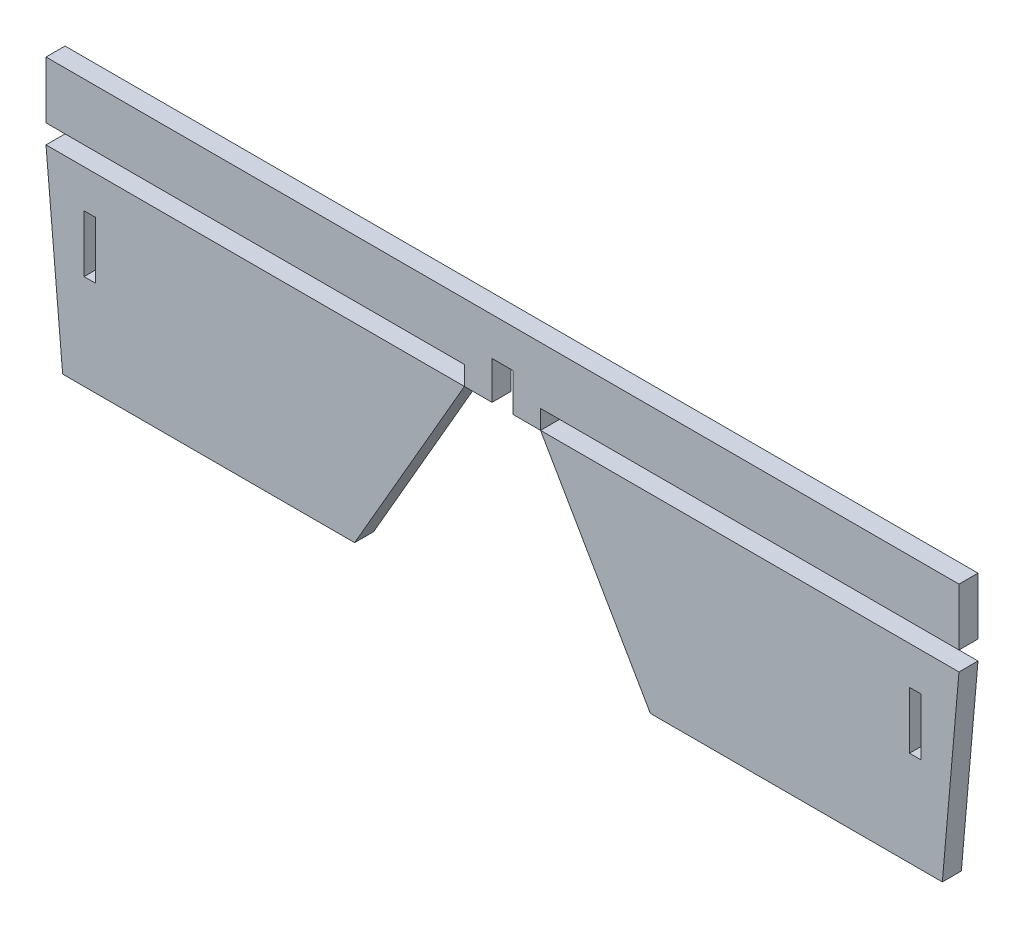
ISO-10303-21;
HEADER;
FILE_DESCRIPTION(('STEP AP214'),'2;1');
FILE_NAME('part.step','',(''),(''),'','','');
FILE_SCHEMA(('AUTOMOTIVE_DESIGN { 1 0 10303 214 1 1 1 1 }'));
ENDSEC;
DATA;
#1=APPLICATION_CONTEXT('core data for automotive mechanical design processes');
#2=APPLICATION_PROTOCOL_DEFINITION('international standard','automotive_design',2000,#1);
#3=PRODUCT_CONTEXT('',#1,'mechanical');
#4=PRODUCT('Part','Part','',(#3));
#5=PRODUCT_RELATED_PRODUCT_CATEGORY('part','',(#4));
#6=PRODUCT_DEFINITION_FORMATION('','',#4);
#7=PRODUCT_DEFINITION_CONTEXT('part definition',#1,'design');
#8=PRODUCT_DEFINITION('design','',#6,#7);
#9=PRODUCT_DEFINITION_SHAPE('','',#8);
#10=(LENGTH_UNIT() NAMED_UNIT(*) SI_UNIT(.MILLI.,.METRE.));
#11=(NAMED_UNIT(*) PLANE_ANGLE_UNIT() SI_UNIT($,.RADIAN.));
#12=(NAMED_UNIT(*) SI_UNIT($,.STERADIAN.) SOLID_ANGLE_UNIT());
#13=UNCERTAINTY_MEASURE_WITH_UNIT(LENGTH_MEASURE(1.E-05),#10,'distance_accuracy_value','');
#14=(GEOMETRIC_REPRESENTATION_CONTEXT(3) GLOBAL_UNCERTAINTY_ASSIGNED_CONTEXT((#13)) GLOBAL_UNIT_ASSIGNED_CONTEXT((#10,
#11,#12)) REPRESENTATION_CONTEXT('',''));
#15=CARTESIAN_POINT('',(0.,0.,0.));
#16=DIRECTION('',(0.,0.,1.));
#17=DIRECTION('',(1.,0.,0.));
#18=AXIS2_PLACEMENT_3D('',#15,#16,#17);
#19=CARTESIAN_POINT('',(0.,-20.,2.5));
#20=DIRECTION('',(0.,1.,0.));
#21=DIRECTION('',(0.,0.,1.));
#22=AXIS2_PLACEMENT_3D('',#19,#20,#21);
#23=PLANE('',#22);
#24=DIRECTION('',(-1.,0.,0.));
#25=VECTOR('',#24,1.);
#26=CARTESIAN_POINT('',(0.,-20.,-2.5));
#27=LINE('',#26,#25);
#28=CARTESIAN_POINT('',(110.,-20.,-2.5));
#29=VERTEX_POINT('',#28);
#30=CARTESIAN_POINT('',(107.,-20.,-2.5));
#31=VERTEX_POINT('',#30);
#32=EDGE_CURVE('E154',#29,#31,#27,.T.);
#33=ORIENTED_EDGE('',*,*,#32,.F.);
#34=DIRECTION('',(0.,0.,-1.));
#35=VECTOR('',#34,1.);
#36=CARTESIAN_POINT('',(110.,-20.,2.5));
#37=LINE('',#36,#35);
#38=CARTESIAN_POINT('',(110.,-20.,2.5));
#39=VERTEX_POINT('',#38);
#40=EDGE_CURVE('E161',#39,#29,#37,.T.);
#41=ORIENTED_EDGE('',*,*,#40,.F.);
#42=DIRECTION('',(-1.,0.,0.));
#43=VECTOR('',#42,1.);
#44=CARTESIAN_POINT('',(0.,-20.,2.5));
#45=LINE('',#44,#43);
#46=CARTESIAN_POINT('',(107.,-20.,2.5));
#47=VERTEX_POINT('',#46);
#48=EDGE_CURVE('E136',#39,#47,#45,.T.);
#49=ORIENTED_EDGE('',*,*,#48,.T.);
#50=DIRECTION('',(0.,0.,-1.));
#51=VECTOR('',#50,1.);
#52=CARTESIAN_POINT('',(107.,-20.,2.5));
#53=LINE('',#52,#51);
#54=EDGE_CURVE('E12',#47,#31,#53,.T.);
#55=ORIENTED_EDGE('',*,*,#54,.T.);
#56=EDGE_LOOP('',(#33,#41,#49,#55));
#57=FACE_BOUND('',#56,.T.);
#58=ADVANCED_FACE('F46',(#57),#23,.F.);
#59=CARTESIAN_POINT('',(107.,0.,2.5));
#60=DIRECTION('',(-1.,0.,0.));
#61=DIRECTION('',(0.,1.,0.));
#62=AXIS2_PLACEMENT_3D('',#59,#60,#61);
#63=PLANE('',#62);
#64=DIRECTION('',(0.,-1.,0.));
#65=VECTOR('',#64,1.);
#66=CARTESIAN_POINT('',(107.,0.,-2.5));
#67=LINE('',#66,#65);
#68=CARTESIAN_POINT('',(107.,-35.,-2.5));
#69=VERTEX_POINT('',#68);
#70=EDGE_CURVE('E156',#31,#69,#67,.T.);
#71=ORIENTED_EDGE('',*,*,#70,.F.);
#72=ORIENTED_EDGE('',*,*,#54,.F.);
#73=DIRECTION('',(0.,-1.,0.));
#74=VECTOR('',#73,1.);
#75=CARTESIAN_POINT('',(107.,0.,2.5));
#76=LINE('',#75,#74);
#77=CARTESIAN_POINT('',(107.,-35.,2.5));
#78=VERTEX_POINT('',#77);
#79=EDGE_CURVE('E123',#47,#78,#76,.T.);
#80=ORIENTED_EDGE('',*,*,#79,.T.);
#81=DIRECTION('',(0.,0.,-1.));
#82=VECTOR('',#81,1.);
#83=CARTESIAN_POINT('',(107.,-35.,2.5));
#84=LINE('',#83,#82);
#85=EDGE_CURVE('E56',#78,#69,#84,.T.);
#86=ORIENTED_EDGE('',*,*,#85,.T.);
#87=EDGE_LOOP('',(#71,#72,#80,#86));
#88=FACE_BOUND('',#87,.T.);
#89=ADVANCED_FACE('F134',(#88),#63,.F.);
#90=CARTESIAN_POINT('',(0.,-35.,2.5));
#91=DIRECTION('',(0.,1.,0.));
#92=DIRECTION('',(0.,0.,1.));
#93=AXIS2_PLACEMENT_3D('',#90,#91,#92);
#94=PLANE('',#93);
#95=DIRECTION('',(-1.,0.,0.));
#96=VECTOR('',#95,1.);
#97=CARTESIAN_POINT('',(0.,-35.,-2.5));
#98=LINE('',#97,#96);
#99=CARTESIAN_POINT('',(110.,-35.,-2.5));
#100=VERTEX_POINT('',#99);
#101=EDGE_CURVE('E129',#100,#69,#98,.T.);
#102=ORIENTED_EDGE('',*,*,#101,.T.);
#103=ORIENTED_EDGE('',*,*,#85,.F.);
#104=DIRECTION('',(-1.,0.,0.));
#105=VECTOR('',#104,1.);
#106=CARTESIAN_POINT('',(0.,-35.,2.5));
#107=LINE('',#106,#105);
#108=CARTESIAN_POINT('',(110.,-35.,2.5));
#109=VERTEX_POINT('',#108);
#110=EDGE_CURVE('E119',#109,#78,#107,.T.);
#111=ORIENTED_EDGE('',*,*,#110,.F.);
#112=DIRECTION('',(0.,0.,-1.));
#113=VECTOR('',#112,1.);
#114=CARTESIAN_POINT('',(110.,-35.,2.5));
#115=LINE('',#114,#113);
#116=EDGE_CURVE('E132',#109,#100,#115,.T.);
#117=ORIENTED_EDGE('',*,*,#116,.T.);
#118=EDGE_LOOP('',(#102,#103,#111,#117));
#119=FACE_BOUND('',#118,.T.);
#120=ADVANCED_FACE('F128',(#119),#94,.T.);
#121=CARTESIAN_POINT('',(119.956706069067,-10.4948518949548,2.5));
#122=DIRECTION('',(-0.996194698091746,0.0871557427476584,0.));
#123=DIRECTION('',(0.0871557427476584,0.996194698091746,0.));
#124=AXIS2_PLACEMENT_3D('',#121,#122,#123);
#125=PLANE('',#124);
#126=DIRECTION('',(-0.0871557427476584,-0.996194698091746,0.));
#127=VECTOR('',#126,1.);
#128=CARTESIAN_POINT('',(119.956706069067,-10.4948518949548,-2.5));
#129=LINE('',#128,#127);
#130=CARTESIAN_POINT('',(120.,-10.,-2.5));
#131=VERTEX_POINT('',#130);
#132=CARTESIAN_POINT('',(115.625566823704,-60.,-2.5));
#133=VERTEX_POINT('',#132);
#134=EDGE_CURVE('E144',#131,#133,#129,.T.);
#135=ORIENTED_EDGE('',*,*,#134,.F.);
#136=DIRECTION('',(0.,0.,-1.));
#137=VECTOR('',#136,1.);
#138=CARTESIAN_POINT('',(120.,-10.,2.5));
#139=LINE('',#138,#137);
#140=CARTESIAN_POINT('',(120.,-10.,2.5));
#141=VERTEX_POINT('',#140);
#142=EDGE_CURVE('E143',#141,#131,#139,.T.);
#143=ORIENTED_EDGE('',*,*,#142,.F.);
#144=DIRECTION('',(-0.0871557427476584,-0.996194698091746,0.));
#145=VECTOR('',#144,1.);
#146=CARTESIAN_POINT('',(119.956706069067,-10.4948518949548,2.5));
#147=LINE('',#146,#145);
#148=CARTESIAN_POINT('',(115.625566823704,-60.,2.5));
#149=VERTEX_POINT('',#148);
#150=EDGE_CURVE('E160',#141,#149,#147,.T.);
#151=ORIENTED_EDGE('',*,*,#150,.T.);
#152=DIRECTION('',(0.,0.,-1.));
#153=VECTOR('',#152,1.);
#154=CARTESIAN_POINT('',(115.625566823704,-60.,2.5));
#155=LINE('',#154,#153);
#156=EDGE_CURVE('E50',#149,#133,#155,.T.);
#157=ORIENTED_EDGE('',*,*,#156,.T.);
#158=EDGE_LOOP('',(#135,#143,#151,#157));
#159=FACE_BOUND('',#158,.T.);
#160=ADVANCED_FACE('F48',(#159),#125,.F.);
#161=CARTESIAN_POINT('',(0.,-60.,2.5));
#162=DIRECTION('',(0.,1.,0.));
#163=DIRECTION('',(1.,0.,0.));
#164=AXIS2_PLACEMENT_3D('',#161,#162,#163);
#165=PLANE('',#164);
#166=DIRECTION('',(-1.,0.,0.));
#167=VECTOR('',#166,1.);
#168=CARTESIAN_POINT('',(0.,-60.,-2.5));
#169=LINE('',#168,#167);
#170=CARTESIAN_POINT('',(38.8675134594816,-60.,-2.5));
#171=VERTEX_POINT('',#170);
#172=EDGE_CURVE('E147',#133,#171,#169,.T.);
#173=ORIENTED_EDGE('',*,*,#172,.F.);
#174=ORIENTED_EDGE('',*,*,#156,.F.);
#175=DIRECTION('',(-1.,0.,0.));
#176=VECTOR('',#175,1.);
#177=CARTESIAN_POINT('',(0.,-60.,2.5));
#178=LINE('',#177,#176);
#179=CARTESIAN_POINT('',(38.8675134594816,-60.,2.5));
#180=VERTEX_POINT('',#179);
#181=EDGE_CURVE('E104',#149,#180,#178,.T.);
#182=ORIENTED_EDGE('',*,*,#181,.T.);
#183=DIRECTION('',(0.,0.,-1.));
#184=VECTOR('',#183,1.);
#185=CARTESIAN_POINT('',(38.8675134594816,-60.,2.5));
#186=LINE('',#185,#184);
#187=EDGE_CURVE('E168',#180,#171,#186,.T.);
#188=ORIENTED_EDGE('',*,*,#187,.T.);
#189=EDGE_LOOP('',(#173,#174,#182,#188));
#190=FACE_BOUND('',#189,.T.);
#191=ADVANCED_FACE('F190',(#190),#165,.F.);
#192=CARTESIAN_POINT('',(3.16987298107774,1.83012701892218,2.5));
#193=DIRECTION('',(-0.866025403784436,-0.500000000000004,0.));
#194=DIRECTION('',(-0.500000000000004,0.866025403784436,0.));
#195=AXIS2_PLACEMENT_3D('',#192,#193,#194);
#196=PLANE('',#195);
#197=DIRECTION('',(0.500000000000004,-0.866025403784436,0.));
#198=VECTOR('',#197,1.);
#199=CARTESIAN_POINT('',(3.16987298107774,1.83012701892218,-2.5));
#200=LINE('',#199,#198);
#201=CARTESIAN_POINT('',(10.,-10.,-2.5));
#202=VERTEX_POINT('',#201);
#203=EDGE_CURVE('E150',#202,#171,#200,.T.);
#204=ORIENTED_EDGE('',*,*,#203,.T.);
#205=ORIENTED_EDGE('',*,*,#187,.F.);
#206=DIRECTION('',(0.500000000000004,-0.866025403784436,0.));
#207=VECTOR('',#206,1.);
#208=CARTESIAN_POINT('',(3.16987298107774,1.83012701892218,2.5));
#209=LINE('',#208,#207);
#210=CARTESIAN_POINT('',(10.,-10.,2.5));
#211=VERTEX_POINT('',#210);
#212=EDGE_CURVE('E184',#211,#180,#209,.T.);
#213=ORIENTED_EDGE('',*,*,#212,.F.);
#214=DIRECTION('',(0.,0.,-1.));
#215=VECTOR('',#214,1.);
#216=CARTESIAN_POINT('',(10.,-10.,2.5));
#217=LINE('',#216,#215);
#218=EDGE_CURVE('E166',#211,#202,#217,.T.);
#219=ORIENTED_EDGE('',*,*,#218,.T.);
#220=EDGE_LOOP('',(#204,#205,#213,#219));
#221=FACE_BOUND('',#220,.T.);
#222=ADVANCED_FACE('F189',(#221),#196,.T.);
#223=CARTESIAN_POINT('',(0.,-10.,2.5));
#224=DIRECTION('',(0.,1.,0.));
#225=DIRECTION('',(0.,0.,1.));
#226=AXIS2_PLACEMENT_3D('',#223,#224,#225);
#227=PLANE('',#226);
#228=DIRECTION('',(-1.,0.,0.));
#229=VECTOR('',#228,1.);
#230=CARTESIAN_POINT('',(0.,-10.,-2.5));
#231=LINE('',#230,#229);
#232=EDGE_CURVE('E152',#131,#202,#231,.T.);
#233=ORIENTED_EDGE('',*,*,#232,.T.);
#234=ORIENTED_EDGE('',*,*,#218,.F.);
#235=DIRECTION('',(-1.,0.,0.));
#236=VECTOR('',#235,1.);
#237=CARTESIAN_POINT('',(0.,-10.,2.5));
#238=LINE('',#237,#236);
#239=EDGE_CURVE('E138',#141,#211,#238,.T.);
#240=ORIENTED_EDGE('',*,*,#239,.F.);
#241=ORIENTED_EDGE('',*,*,#142,.T.);
#242=EDGE_LOOP('',(#233,#234,#240,#241));
#243=FACE_BOUND('',#242,.T.);
#244=ADVANCED_FACE('F182',(#243),#227,.T.);
#245=CARTESIAN_POINT('',(110.,0.,2.5));
#246=DIRECTION('',(-1.,0.,0.));
#247=DIRECTION('',(0.,0.,-1.));
#248=AXIS2_PLACEMENT_3D('',#245,#246,#247);
#249=PLANE('',#248);
#250=DIRECTION('',(0.,-1.,0.));
#251=VECTOR('',#250,1.);
#252=CARTESIAN_POINT('',(110.,0.,-2.5));
#253=LINE('',#252,#251);
#254=EDGE_CURVE('E91',#29,#100,#253,.T.);
#255=ORIENTED_EDGE('',*,*,#254,.T.);
#256=ORIENTED_EDGE('',*,*,#116,.F.);
#257=DIRECTION('',(0.,-1.,0.));
#258=VECTOR('',#257,1.);
#259=CARTESIAN_POINT('',(110.,0.,2.5));
#260=LINE('',#259,#258);
#261=EDGE_CURVE('E65',#39,#109,#260,.T.);
#262=ORIENTED_EDGE('',*,*,#261,.F.);
#263=ORIENTED_EDGE('',*,*,#40,.T.);
#264=EDGE_LOOP('',(#255,#256,#262,#263));
#265=FACE_BOUND('',#264,.T.);
#266=ADVANCED_FACE('F208',(#265),#249,.T.);
#267=CARTESIAN_POINT('',(0.,0.,2.5));
#268=DIRECTION('',(0.,0.,1.));
#269=DIRECTION('',(-1.,0.,0.));
#270=AXIS2_PLACEMENT_3D('',#267,#268,#269);
#271=PLANE('',#270);
#272=ORIENTED_EDGE('',*,*,#150,.F.);
#273=ORIENTED_EDGE('',*,*,#239,.T.);
#274=ORIENTED_EDGE('',*,*,#212,.T.);
#275=ORIENTED_EDGE('',*,*,#181,.F.);
#276=EDGE_LOOP('',(#272,#273,#274,#275));
#277=FACE_BOUND('',#276,.T.);
#278=ORIENTED_EDGE('',*,*,#48,.F.);
#279=ORIENTED_EDGE('',*,*,#261,.T.);
#280=ORIENTED_EDGE('',*,*,#110,.T.);
#281=ORIENTED_EDGE('',*,*,#79,.F.);
#282=EDGE_LOOP('',(#278,#279,#280,#281));
#283=FACE_BOUND('',#282,.T.);
#284=ADVANCED_FACE('F121',(#277,#283),#271,.T.);
#285=CARTESIAN_POINT('',(0.,0.,-2.5));
#286=DIRECTION('',(0.,0.,1.));
#287=DIRECTION('',(-1.,0.,0.));
#288=AXIS2_PLACEMENT_3D('',#285,#286,#287);
#289=PLANE('',#288);
#290=ORIENTED_EDGE('',*,*,#134,.T.);
#291=ORIENTED_EDGE('',*,*,#172,.T.);
#292=ORIENTED_EDGE('',*,*,#203,.F.);
#293=ORIENTED_EDGE('',*,*,#232,.F.);
#294=EDGE_LOOP('',(#290,#291,#292,#293));
#295=FACE_BOUND('',#294,.T.);
#296=ORIENTED_EDGE('',*,*,#32,.T.);
#297=ORIENTED_EDGE('',*,*,#70,.T.);
#298=ORIENTED_EDGE('',*,*,#101,.F.);
#299=ORIENTED_EDGE('',*,*,#254,.F.);
#300=EDGE_LOOP('',(#296,#297,#298,#299));
#301=FACE_BOUND('',#300,.T.);
#302=ADVANCED_FACE('F178',(#295,#301),#289,.F.);
#303=CLOSED_SHELL('',(#58,#89,#120,#160,#191,#222,#244,#266,#284,#302));
#304=MANIFOLD_SOLID_BREP('B2',#303);
#305=CARTESIAN_POINT('',(0.,-5.,2.5));
#306=DIRECTION('',(0.,1.,0.));
#307=DIRECTION('',(0.,0.,1.));
#308=AXIS2_PLACEMENT_3D('',#305,#306,#307);
#309=PLANE('',#308);
#310=DIRECTION('',(1.,0.,0.));
#311=VECTOR('',#310,1.);
#312=CARTESIAN_POINT('',(0.,-5.,-2.5));
#313=LINE('',#312,#311);
#314=CARTESIAN_POINT('',(-120.,-5.,-2.5));
#315=VERTEX_POINT('',#314);
#316=CARTESIAN_POINT('',(-10.,-5.,-2.5));
#317=VERTEX_POINT('',#316);
#318=EDGE_CURVE('E385',#315,#317,#313,.T.);
#319=ORIENTED_EDGE('',*,*,#318,.T.);
#320=DIRECTION('',(0.,0.,-1.));
#321=VECTOR('',#320,1.);
#322=CARTESIAN_POINT('',(-10.,-5.,2.5));
#323=LINE('',#322,#321);
#324=CARTESIAN_POINT('',(-10.,-5.,2.5));
#325=VERTEX_POINT('',#324);
#326=EDGE_CURVE('E44',#325,#317,#323,.T.);
#327=ORIENTED_EDGE('',*,*,#326,.F.);
#328=DIRECTION('',(1.,0.,0.));
#329=VECTOR('',#328,1.);
#330=CARTESIAN_POINT('',(0.,-5.,2.5));
#331=LINE('',#330,#329);
#332=CARTESIAN_POINT('',(-120.,-5.,2.5));
#333=VERTEX_POINT('',#332);
#334=EDGE_CURVE('E401',#333,#325,#331,.T.);
#335=ORIENTED_EDGE('',*,*,#334,.F.);
#336=DIRECTION('',(0.,0.,-1.));
#337=VECTOR('',#336,1.);
#338=CARTESIAN_POINT('',(-120.,-5.,2.5));
#339=LINE('',#338,#337);
#340=EDGE_CURVE('E384',#333,#315,#339,.T.);
#341=ORIENTED_EDGE('',*,*,#340,.T.);
#342=EDGE_LOOP('',(#319,#327,#335,#341));
#343=FACE_BOUND('',#342,.T.);
#344=ADVANCED_FACE('F288',(#343),#309,.F.);
#345=CARTESIAN_POINT('',(-10.,0.,2.5));
#346=DIRECTION('',(1.,0.,0.));
#347=DIRECTION('',(0.,1.,0.));
#348=AXIS2_PLACEMENT_3D('',#345,#346,#347);
#349=PLANE('',#348);
#350=DIRECTION('',(0.,-1.,0.));
#351=VECTOR('',#350,1.);
#352=CARTESIAN_POINT('',(-10.,0.,-2.5));
#353=LINE('',#352,#351);
#354=CARTESIAN_POINT('',(-10.,-10.,-2.5));
#355=VERTEX_POINT('',#354);
#356=EDGE_CURVE('E388',#317,#355,#353,.T.);
#357=ORIENTED_EDGE('',*,*,#356,.T.);
#358=DIRECTION('',(0.,0.,-1.));
#359=VECTOR('',#358,1.);
#360=CARTESIAN_POINT('',(-10.,-10.,2.5));
#361=LINE('',#360,#359);
#362=CARTESIAN_POINT('',(-10.,-10.,2.5));
#363=VERTEX_POINT('',#362);
#364=EDGE_CURVE('E296',#363,#355,#361,.T.);
#365=ORIENTED_EDGE('',*,*,#364,.F.);
#366=DIRECTION('',(0.,-1.,0.));
#367=VECTOR('',#366,1.);
#368=CARTESIAN_POINT('',(-10.,0.,2.5));
#369=LINE('',#368,#367);
#370=EDGE_CURVE('E338',#325,#363,#369,.T.);
#371=ORIENTED_EDGE('',*,*,#370,.F.);
#372=ORIENTED_EDGE('',*,*,#326,.T.);
#373=EDGE_LOOP('',(#357,#365,#371,#372));
#374=FACE_BOUND('',#373,.T.);
#375=ADVANCED_FACE('F441',(#374),#349,.F.);
#376=CARTESIAN_POINT('',(0.,-10.,2.5));
#377=DIRECTION('',(0.,1.,0.));
#378=DIRECTION('',(0.,0.,1.));
#379=AXIS2_PLACEMENT_3D('',#376,#377,#378);
#380=PLANE('',#379);
#381=DIRECTION('',(1.,0.,0.));
#382=VECTOR('',#381,1.);
#383=CARTESIAN_POINT('',(0.,-10.,-2.5));
#384=LINE('',#383,#382);
#385=CARTESIAN_POINT('',(-2.75,-10.,-2.5));
#386=VERTEX_POINT('',#385);
#387=EDGE_CURVE('E391',#355,#386,#384,.T.);
#388=ORIENTED_EDGE('',*,*,#387,.T.);
#389=DIRECTION('',(0.,0.,-1.));
#390=VECTOR('',#389,1.);
#391=CARTESIAN_POINT('',(-2.75,-10.,2.5));
#392=LINE('',#391,#390);
#393=CARTESIAN_POINT('',(-2.75,-10.,2.5));
#394=VERTEX_POINT('',#393);
#395=EDGE_CURVE('E360',#394,#386,#392,.T.);
#396=ORIENTED_EDGE('',*,*,#395,.F.);
#397=DIRECTION('',(1.,0.,0.));
#398=VECTOR('',#397,1.);
#399=CARTESIAN_POINT('',(0.,-10.,2.5));
#400=LINE('',#399,#398);
#401=EDGE_CURVE('E375',#363,#394,#400,.T.);
#402=ORIENTED_EDGE('',*,*,#401,.F.);
#403=ORIENTED_EDGE('',*,*,#364,.T.);
#404=EDGE_LOOP('',(#388,#396,#402,#403));
#405=FACE_BOUND('',#404,.T.);
#406=ADVANCED_FACE('F407',(#405),#380,.F.);
#407=CARTESIAN_POINT('',(-2.75,0.,2.5));
#408=DIRECTION('',(1.,0.,0.));
#409=DIRECTION('',(0.,1.,0.));
#410=AXIS2_PLACEMENT_3D('',#407,#408,#409);
#411=PLANE('',#410);
#412=DIRECTION('',(0.,-1.,0.));
#413=VECTOR('',#412,1.);
#414=CARTESIAN_POINT('',(-2.75,0.,-2.5));
#415=LINE('',#414,#413);
#416=CARTESIAN_POINT('',(-2.75,0.,-2.5));
#417=VERTEX_POINT('',#416);
#418=EDGE_CURVE('E356',#417,#386,#415,.T.);
#419=ORIENTED_EDGE('',*,*,#418,.F.);
#420=DIRECTION('',(0.,0.,-1.));
#421=VECTOR('',#420,1.);
#422=CARTESIAN_POINT('',(-2.75,0.,2.5));
#423=LINE('',#422,#421);
#424=CARTESIAN_POINT('',(-2.75,0.,2.5));
#425=VERTEX_POINT('',#424);
#426=EDGE_CURVE('E350',#425,#417,#423,.T.);
#427=ORIENTED_EDGE('',*,*,#426,.F.);
#428=DIRECTION('',(0.,-1.,0.));
#429=VECTOR('',#428,1.);
#430=CARTESIAN_POINT('',(-2.75,0.,2.5));
#431=LINE('',#430,#429);
#432=EDGE_CURVE('E354',#425,#394,#431,.T.);
#433=ORIENTED_EDGE('',*,*,#432,.T.);
#434=ORIENTED_EDGE('',*,*,#395,.T.);
#435=EDGE_LOOP('',(#419,#427,#433,#434));
#436=FACE_BOUND('',#435,.T.);
#437=ADVANCED_FACE('F352',(#436),#411,.T.);
#438=CARTESIAN_POINT('',(0.,0.,2.5));
#439=DIRECTION('',(0.,1.,0.));
#440=DIRECTION('',(0.,0.,1.));
#441=AXIS2_PLACEMENT_3D('',#438,#439,#440);
#442=PLANE('',#441);
#443=DIRECTION('',(1.,0.,0.));
#444=VECTOR('',#443,1.);
#445=CARTESIAN_POINT('',(0.,0.,-2.5));
#446=LINE('',#445,#444);
#447=CARTESIAN_POINT('',(2.75,0.,-2.5));
#448=VERTEX_POINT('',#447);
#449=EDGE_CURVE('E395',#417,#448,#446,.T.);
#450=ORIENTED_EDGE('',*,*,#449,.T.);
#451=DIRECTION('',(0.,0.,-1.));
#452=VECTOR('',#451,1.);
#453=CARTESIAN_POINT('',(2.75,0.,2.5));
#454=LINE('',#453,#452);
#455=CARTESIAN_POINT('',(2.75,0.,2.5));
#456=VERTEX_POINT('',#455);
#457=EDGE_CURVE('E368',#456,#448,#454,.T.);
#458=ORIENTED_EDGE('',*,*,#457,.F.);
#459=DIRECTION('',(1.,0.,0.));
#460=VECTOR('',#459,1.);
#461=CARTESIAN_POINT('',(0.,0.,2.5));
#462=LINE('',#461,#460);
#463=EDGE_CURVE('E364',#425,#456,#462,.T.);
#464=ORIENTED_EDGE('',*,*,#463,.F.);
#465=ORIENTED_EDGE('',*,*,#426,.T.);
#466=EDGE_LOOP('',(#450,#458,#464,#465));
#467=FACE_BOUND('',#466,.T.);
#468=ADVANCED_FACE('F365',(#467),#442,.F.);
#469=CARTESIAN_POINT('',(0.,10.,2.5));
#470=DIRECTION('',(0.,1.,0.));
#471=DIRECTION('',(0.,0.,1.));
#472=AXIS2_PLACEMENT_3D('',#469,#470,#471);
#473=PLANE('',#472);
#474=DIRECTION('',(1.,0.,0.));
#475=VECTOR('',#474,1.);
#476=CARTESIAN_POINT('',(0.,10.,-2.5));
#477=LINE('',#476,#475);
#478=CARTESIAN_POINT('',(-120.,10.,-2.5));
#479=VERTEX_POINT('',#478);
#480=CARTESIAN_POINT('',(120.,10.,-2.5));
#481=VERTEX_POINT('',#480);
#482=EDGE_CURVE('E397',#479,#481,#477,.T.);
#483=ORIENTED_EDGE('',*,*,#482,.F.);
#484=DIRECTION('',(0.,0.,-1.));
#485=VECTOR('',#484,1.);
#486=CARTESIAN_POINT('',(-120.,10.,2.5));
#487=LINE('',#486,#485);
#488=CARTESIAN_POINT('',(-120.,10.,2.5));
#489=VERTEX_POINT('',#488);
#490=EDGE_CURVE('E327',#489,#479,#487,.T.);
#491=ORIENTED_EDGE('',*,*,#490,.F.);
#492=DIRECTION('',(1.,0.,0.));
#493=VECTOR('',#492,1.);
#494=CARTESIAN_POINT('',(0.,10.,2.5));
#495=LINE('',#494,#493);
#496=CARTESIAN_POINT('',(120.,10.,2.5));
#497=VERTEX_POINT('',#496);
#498=EDGE_CURVE('E371',#489,#497,#495,.T.);
#499=ORIENTED_EDGE('',*,*,#498,.T.);
#500=DIRECTION('',(0.,0.,-1.));
#501=VECTOR('',#500,1.);
#502=CARTESIAN_POINT('',(120.,10.,2.5));
#503=LINE('',#502,#501);
#504=EDGE_CURVE('E425',#497,#481,#503,.T.);
#505=ORIENTED_EDGE('',*,*,#504,.T.);
#506=EDGE_LOOP('',(#483,#491,#499,#505));
#507=FACE_BOUND('',#506,.T.);
#508=ADVANCED_FACE('F453',(#507),#473,.T.);
#509=CARTESIAN_POINT('',(-120.,0.,2.5));
#510=DIRECTION('',(1.,0.,0.));
#511=DIRECTION('',(0.,0.,-1.));
#512=AXIS2_PLACEMENT_3D('',#509,#510,#511);
#513=PLANE('',#512);
#514=DIRECTION('',(0.,-1.,0.));
#515=VECTOR('',#514,1.);
#516=CARTESIAN_POINT('',(-120.,0.,-2.5));
#517=LINE('',#516,#515);
#518=EDGE_CURVE('E330',#479,#315,#517,.T.);
#519=ORIENTED_EDGE('',*,*,#518,.T.);
#520=ORIENTED_EDGE('',*,*,#340,.F.);
#521=DIRECTION('',(0.,-1.,0.));
#522=VECTOR('',#521,1.);
#523=CARTESIAN_POINT('',(-120.,0.,2.5));
#524=LINE('',#523,#522);
#525=EDGE_CURVE('E304',#489,#333,#524,.T.);
#526=ORIENTED_EDGE('',*,*,#525,.F.);
#527=ORIENTED_EDGE('',*,*,#490,.T.);
#528=EDGE_LOOP('',(#519,#520,#526,#527));
#529=FACE_BOUND('',#528,.T.);
#530=ADVANCED_FACE('F456',(#529),#513,.F.);
#531=CARTESIAN_POINT('',(0.,0.,2.5));
#532=DIRECTION('',(0.,0.,1.));
#533=DIRECTION('',(1.,0.,0.));
#534=AXIS2_PLACEMENT_3D('',#531,#532,#533);
#535=PLANE('',#534);
#536=ORIENTED_EDGE('',*,*,#334,.T.);
#537=ORIENTED_EDGE('',*,*,#370,.T.);
#538=ORIENTED_EDGE('',*,*,#401,.T.);
#539=ORIENTED_EDGE('',*,*,#432,.F.);
#540=ORIENTED_EDGE('',*,*,#463,.T.);
#541=DIRECTION('',(0.,-1.,0.));
#542=VECTOR('',#541,1.);
#543=CARTESIAN_POINT('',(2.75,0.,2.5));
#544=LINE('',#543,#542);
#545=CARTESIAN_POINT('',(2.75,-10.,2.5));
#546=VERTEX_POINT('',#545);
#547=EDGE_CURVE('E423',#456,#546,#544,.T.);
#548=ORIENTED_EDGE('',*,*,#547,.T.);
#549=DIRECTION('',(-1.,0.,0.));
#550=VECTOR('',#549,1.);
#551=CARTESIAN_POINT('',(0.,-10.,2.5));
#552=LINE('',#551,#550);
#553=CARTESIAN_POINT('',(10.,-10.,2.5));
#554=VERTEX_POINT('',#553);
#555=EDGE_CURVE('E503',#554,#546,#552,.T.);
#556=ORIENTED_EDGE('',*,*,#555,.F.);
#557=DIRECTION('',(0.,-1.,0.));
#558=VECTOR('',#557,1.);
#559=CARTESIAN_POINT('',(10.,0.,2.5));
#560=LINE('',#559,#558);
#561=CARTESIAN_POINT('',(10.,-5.,2.5));
#562=VERTEX_POINT('',#561);
#563=EDGE_CURVE('E525',#562,#554,#560,.T.);
#564=ORIENTED_EDGE('',*,*,#563,.F.);
#565=DIRECTION('',(-1.,0.,0.));
#566=VECTOR('',#565,1.);
#567=CARTESIAN_POINT('',(0.,-5.,2.5));
#568=LINE('',#567,#566);
#569=CARTESIAN_POINT('',(120.,-5.,2.5));
#570=VERTEX_POINT('',#569);
#571=EDGE_CURVE('E493',#570,#562,#568,.T.);
#572=ORIENTED_EDGE('',*,*,#571,.F.);
#573=DIRECTION('',(0.,-1.,0.));
#574=VECTOR('',#573,1.);
#575=CARTESIAN_POINT('',(120.,0.,2.5));
#576=LINE('',#575,#574);
#577=EDGE_CURVE('E499',#497,#570,#576,.T.);
#578=ORIENTED_EDGE('',*,*,#577,.F.);
#579=ORIENTED_EDGE('',*,*,#498,.F.);
#580=ORIENTED_EDGE('',*,*,#525,.T.);
#581=EDGE_LOOP('',(#536,#537,#538,#539,#540,#548,#556,#564,#572,#578,#579,#580));
#582=FACE_BOUND('',#581,.T.);
#583=ADVANCED_FACE('F373',(#582),#535,.T.);
#584=CARTESIAN_POINT('',(0.,0.,-2.5));
#585=DIRECTION('',(0.,0.,1.));
#586=DIRECTION('',(1.,0.,0.));
#587=AXIS2_PLACEMENT_3D('',#584,#585,#586);
#588=PLANE('',#587);
#589=ORIENTED_EDGE('',*,*,#318,.F.);
#590=ORIENTED_EDGE('',*,*,#518,.F.);
#591=ORIENTED_EDGE('',*,*,#482,.T.);
#592=DIRECTION('',(0.,-1.,0.));
#593=VECTOR('',#592,1.);
#594=CARTESIAN_POINT('',(120.,0.,-2.5));
#595=LINE('',#594,#593);
#596=CARTESIAN_POINT('',(120.,-5.,-2.5));
#597=VERTEX_POINT('',#596);
#598=EDGE_CURVE('E487',#481,#597,#595,.T.);
#599=ORIENTED_EDGE('',*,*,#598,.T.);
#600=DIRECTION('',(-1.,0.,0.));
#601=VECTOR('',#600,1.);
#602=CARTESIAN_POINT('',(0.,-5.,-2.5));
#603=LINE('',#602,#601);
#604=CARTESIAN_POINT('',(10.,-5.,-2.5));
#605=VERTEX_POINT('',#604);
#606=EDGE_CURVE('E507',#597,#605,#603,.T.);
#607=ORIENTED_EDGE('',*,*,#606,.T.);
#608=DIRECTION('',(0.,-1.,0.));
#609=VECTOR('',#608,1.);
#610=CARTESIAN_POINT('',(10.,0.,-2.5));
#611=LINE('',#610,#609);
#612=CARTESIAN_POINT('',(10.,-10.,-2.5));
#613=VERTEX_POINT('',#612);
#614=EDGE_CURVE('E509',#605,#613,#611,.T.);
#615=ORIENTED_EDGE('',*,*,#614,.T.);
#616=DIRECTION('',(-1.,0.,0.));
#617=VECTOR('',#616,1.);
#618=CARTESIAN_POINT('',(0.,-10.,-2.5));
#619=LINE('',#618,#617);
#620=CARTESIAN_POINT('',(2.75,-10.,-2.5));
#621=VERTEX_POINT('',#620);
#622=EDGE_CURVE('E512',#613,#621,#619,.T.);
#623=ORIENTED_EDGE('',*,*,#622,.T.);
#624=DIRECTION('',(0.,-1.,0.));
#625=VECTOR('',#624,1.);
#626=CARTESIAN_POINT('',(2.75,0.,-2.5));
#627=LINE('',#626,#625);
#628=EDGE_CURVE('E415',#448,#621,#627,.T.);
#629=ORIENTED_EDGE('',*,*,#628,.F.);
#630=ORIENTED_EDGE('',*,*,#449,.F.);
#631=ORIENTED_EDGE('',*,*,#418,.T.);
#632=ORIENTED_EDGE('',*,*,#387,.F.);
#633=ORIENTED_EDGE('',*,*,#356,.F.);
#634=EDGE_LOOP('',(#589,#590,#591,#599,#607,#615,#623,#629,#630,#631,#632,#633));
#635=FACE_BOUND('',#634,.T.);
#636=ADVANCED_FACE('F410',(#635),#588,.F.);
#637=CARTESIAN_POINT('',(0.,-5.,2.5));
#638=DIRECTION('',(0.,1.,0.));
#639=DIRECTION('',(0.,0.,1.));
#640=AXIS2_PLACEMENT_3D('',#637,#638,#639);
#641=PLANE('',#640);
#642=ORIENTED_EDGE('',*,*,#606,.F.);
#643=DIRECTION('',(0.,0.,-1.));
#644=VECTOR('',#643,1.);
#645=CARTESIAN_POINT('',(120.,-5.,2.5));
#646=LINE('',#645,#644);
#647=EDGE_CURVE('E430',#570,#597,#646,.T.);
#648=ORIENTED_EDGE('',*,*,#647,.F.);
#649=ORIENTED_EDGE('',*,*,#571,.T.);
#650=DIRECTION('',(0.,0.,-1.));
#651=VECTOR('',#650,1.);
#652=CARTESIAN_POINT('',(10.,-5.,2.5));
#653=LINE('',#652,#651);
#654=EDGE_CURVE('E389',#562,#605,#653,.T.);
#655=ORIENTED_EDGE('',*,*,#654,.T.);
#656=EDGE_LOOP('',(#642,#648,#649,#655));
#657=FACE_BOUND('',#656,.T.);
#658=ADVANCED_FACE('F462',(#657),#641,.F.);
#659=CARTESIAN_POINT('',(10.,0.,2.5));
#660=DIRECTION('',(-1.,0.,0.));
#661=DIRECTION('',(0.,1.,0.));
#662=AXIS2_PLACEMENT_3D('',#659,#660,#661);
#663=PLANE('',#662);
#664=ORIENTED_EDGE('',*,*,#614,.F.);
#665=ORIENTED_EDGE('',*,*,#654,.F.);
#666=ORIENTED_EDGE('',*,*,#563,.T.);
#667=DIRECTION('',(0.,0.,-1.));
#668=VECTOR('',#667,1.);
#669=CARTESIAN_POINT('',(10.,-10.,2.5));
#670=LINE('',#669,#668);
#671=EDGE_CURVE('E427',#554,#613,#670,.T.);
#672=ORIENTED_EDGE('',*,*,#671,.T.);
#673=EDGE_LOOP('',(#664,#665,#666,#672));
#674=FACE_BOUND('',#673,.T.);
#675=ADVANCED_FACE('F467',(#674),#663,.F.);
#676=CARTESIAN_POINT('',(0.,-10.,2.5));
#677=DIRECTION('',(0.,1.,0.));
#678=DIRECTION('',(0.,0.,1.));
#679=AXIS2_PLACEMENT_3D('',#676,#677,#678);
#680=PLANE('',#679);
#681=ORIENTED_EDGE('',*,*,#622,.F.);
#682=ORIENTED_EDGE('',*,*,#671,.F.);
#683=ORIENTED_EDGE('',*,*,#555,.T.);
#684=DIRECTION('',(0.,0.,-1.));
#685=VECTOR('',#684,1.);
#686=CARTESIAN_POINT('',(2.75,-10.,2.5));
#687=LINE('',#686,#685);
#688=EDGE_CURVE('E424',#546,#621,#687,.T.);
#689=ORIENTED_EDGE('',*,*,#688,.T.);
#690=EDGE_LOOP('',(#681,#682,#683,#689));
#691=FACE_BOUND('',#690,.T.);
#692=ADVANCED_FACE('F471',(#691),#680,.F.);
#693=CARTESIAN_POINT('',(2.75,0.,2.5));
#694=DIRECTION('',(-1.,0.,0.));
#695=DIRECTION('',(0.,1.,0.));
#696=AXIS2_PLACEMENT_3D('',#693,#694,#695);
#697=PLANE('',#696);
#698=ORIENTED_EDGE('',*,*,#628,.T.);
#699=ORIENTED_EDGE('',*,*,#688,.F.);
#700=ORIENTED_EDGE('',*,*,#547,.F.);
#701=ORIENTED_EDGE('',*,*,#457,.T.);
#702=EDGE_LOOP('',(#698,#699,#700,#701));
#703=FACE_BOUND('',#702,.T.);
#704=ADVANCED_FACE('F420',(#703),#697,.T.);
#705=CARTESIAN_POINT('',(120.,0.,2.5));
#706=DIRECTION('',(-1.,0.,0.));
#707=DIRECTION('',(0.,0.,-1.));
#708=AXIS2_PLACEMENT_3D('',#705,#706,#707);
#709=PLANE('',#708);
#710=ORIENTED_EDGE('',*,*,#598,.F.);
#711=ORIENTED_EDGE('',*,*,#504,.F.);
#712=ORIENTED_EDGE('',*,*,#577,.T.);
#713=ORIENTED_EDGE('',*,*,#647,.T.);
#714=EDGE_LOOP('',(#710,#711,#712,#713));
#715=FACE_BOUND('',#714,.T.);
#716=ADVANCED_FACE('F478',(#715),#709,.F.);
#717=CLOSED_SHELL('',(#344,#375,#406,#437,#468,#508,#530,#583,#636,#658,#675,#692,#704,#716));
#718=MANIFOLD_SOLID_BREP('B6',#717);
#719=CARTESIAN_POINT('',(0.,-20.,2.5));
#720=DIRECTION('',(0.,1.,0.));
#721=DIRECTION('',(0.,0.,1.));
#722=AXIS2_PLACEMENT_3D('',#719,#720,#721);
#723=PLANE('',#722);
#724=DIRECTION('',(1.,0.,0.));
#725=VECTOR('',#724,1.);
#726=CARTESIAN_POINT('',(0.,-20.,-2.5));
#727=LINE('',#726,#725);
#728=CARTESIAN_POINT('',(-110.,-20.,-2.5));
#729=VERTEX_POINT('',#728);
#730=CARTESIAN_POINT('',(-107.,-20.,-2.5));
#731=VERTEX_POINT('',#730);
#732=EDGE_CURVE('E747',#729,#731,#727,.T.);
#733=ORIENTED_EDGE('',*,*,#732,.T.);
#734=DIRECTION('',(0.,0.,-1.));
#735=VECTOR('',#734,1.);
#736=CARTESIAN_POINT('',(-107.,-20.,2.5));
#737=LINE('',#736,#735);
#738=CARTESIAN_POINT('',(-107.,-20.,2.5));
#739=VERTEX_POINT('',#738);
#740=EDGE_CURVE('E286',#739,#731,#737,.T.);
#741=ORIENTED_EDGE('',*,*,#740,.F.);
#742=DIRECTION('',(1.,0.,0.));
#743=VECTOR('',#742,1.);
#744=CARTESIAN_POINT('',(0.,-20.,2.5));
#745=LINE('',#744,#743);
#746=CARTESIAN_POINT('',(-110.,-20.,2.5));
#747=VERTEX_POINT('',#746);
#748=EDGE_CURVE('E718',#747,#739,#745,.T.);
#749=ORIENTED_EDGE('',*,*,#748,.F.);
#750=DIRECTION('',(0.,0.,-1.));
#751=VECTOR('',#750,1.);
#752=CARTESIAN_POINT('',(-110.,-20.,2.5));
#753=LINE('',#752,#751);
#754=EDGE_CURVE('E657',#747,#729,#753,.T.);
#755=ORIENTED_EDGE('',*,*,#754,.T.);
#756=EDGE_LOOP('',(#733,#741,#749,#755));
#757=FACE_BOUND('',#756,.T.);
#758=ADVANCED_FACE('F638',(#757),#723,.F.);
#759=CARTESIAN_POINT('',(-107.,0.,2.5));
#760=DIRECTION('',(1.,0.,0.));
#761=DIRECTION('',(0.,1.,0.));
#762=AXIS2_PLACEMENT_3D('',#759,#760,#761);
#763=PLANE('',#762);
#764=DIRECTION('',(0.,-1.,0.));
#765=VECTOR('',#764,1.);
#766=CARTESIAN_POINT('',(-107.,0.,-2.5));
#767=LINE('',#766,#765);
#768=CARTESIAN_POINT('',(-107.,-35.,-2.5));
#769=VERTEX_POINT('',#768);
#770=EDGE_CURVE('E724',#731,#769,#767,.T.);
#771=ORIENTED_EDGE('',*,*,#770,.T.);
#772=DIRECTION('',(0.,0.,-1.));
#773=VECTOR('',#772,1.);
#774=CARTESIAN_POINT('',(-107.,-35.,2.5));
#775=LINE('',#774,#773);
#776=CARTESIAN_POINT('',(-107.,-35.,2.5));
#777=VERTEX_POINT('',#776);
#778=EDGE_CURVE('E648',#777,#769,#775,.T.);
#779=ORIENTED_EDGE('',*,*,#778,.F.);
#780=DIRECTION('',(0.,-1.,0.));
#781=VECTOR('',#780,1.);
#782=CARTESIAN_POINT('',(-107.,0.,2.5));
#783=LINE('',#782,#781);
#784=EDGE_CURVE('E712',#739,#777,#783,.T.);
#785=ORIENTED_EDGE('',*,*,#784,.F.);
#786=ORIENTED_EDGE('',*,*,#740,.T.);
#787=EDGE_LOOP('',(#771,#779,#785,#786));
#788=FACE_BOUND('',#787,.T.);
#789=ADVANCED_FACE('F723',(#788),#763,.F.);
#790=CARTESIAN_POINT('',(0.,-35.,2.5));
#791=DIRECTION('',(0.,1.,0.));
#792=DIRECTION('',(0.,0.,1.));
#793=AXIS2_PLACEMENT_3D('',#790,#791,#792);
#794=PLANE('',#793);
#795=DIRECTION('',(1.,0.,0.));
#796=VECTOR('',#795,1.);
#797=CARTESIAN_POINT('',(0.,-35.,-2.5));
#798=LINE('',#797,#796);
#799=CARTESIAN_POINT('',(-110.,-35.,-2.5));
#800=VERTEX_POINT('',#799);
#801=EDGE_CURVE('E750',#800,#769,#798,.T.);
#802=ORIENTED_EDGE('',*,*,#801,.F.);
#803=DIRECTION('',(0.,0.,-1.));
#804=VECTOR('',#803,1.);
#805=CARTESIAN_POINT('',(-110.,-35.,2.5));
#806=LINE('',#805,#804);
#807=CARTESIAN_POINT('',(-110.,-35.,2.5));
#808=VERTEX_POINT('',#807);
#809=EDGE_CURVE('E683',#808,#800,#806,.T.);
#810=ORIENTED_EDGE('',*,*,#809,.F.);
#811=DIRECTION('',(1.,0.,0.));
#812=VECTOR('',#811,1.);
#813=CARTESIAN_POINT('',(0.,-35.,2.5));
#814=LINE('',#813,#812);
#815=EDGE_CURVE('E717',#808,#777,#814,.T.);
#816=ORIENTED_EDGE('',*,*,#815,.T.);
#817=ORIENTED_EDGE('',*,*,#778,.T.);
#818=EDGE_LOOP('',(#802,#810,#816,#817));
#819=FACE_BOUND('',#818,.T.);
#820=ADVANCED_FACE('F728',(#819),#794,.T.);
#821=CARTESIAN_POINT('',(-119.956706069067,-10.4948518949548,2.5));
#822=DIRECTION('',(0.996194698091746,0.0871557427476584,0.));
#823=DIRECTION('',(-0.0871557427476584,0.996194698091746,0.));
#824=AXIS2_PLACEMENT_3D('',#821,#822,#823);
#825=PLANE('',#824);
#826=DIRECTION('',(0.0871557427476584,-0.996194698091746,0.));
#827=VECTOR('',#826,1.);
#828=CARTESIAN_POINT('',(-119.956706069067,-10.4948518949548,-2.5));
#829=LINE('',#828,#827);
#830=CARTESIAN_POINT('',(-120.,-10.,-2.5));
#831=VERTEX_POINT('',#830);
#832=CARTESIAN_POINT('',(-115.625566823704,-60.,-2.5));
#833=VERTEX_POINT('',#832);
#834=EDGE_CURVE('E735',#831,#833,#829,.T.);
#835=ORIENTED_EDGE('',*,*,#834,.T.);
#836=DIRECTION('',(0.,0.,-1.));
#837=VECTOR('',#836,1.);
#838=CARTESIAN_POINT('',(-115.625566823704,-60.,2.5));
#839=LINE('',#838,#837);
#840=CARTESIAN_POINT('',(-115.625566823704,-60.,2.5));
#841=VERTEX_POINT('',#840);
#842=EDGE_CURVE('E642',#841,#833,#839,.T.);
#843=ORIENTED_EDGE('',*,*,#842,.F.);
#844=DIRECTION('',(0.0871557427476584,-0.996194698091746,0.));
#845=VECTOR('',#844,1.);
#846=CARTESIAN_POINT('',(-119.956706069067,-10.4948518949548,2.5));
#847=LINE('',#846,#845);
#848=CARTESIAN_POINT('',(-120.,-10.,2.5));
#849=VERTEX_POINT('',#848);
#850=EDGE_CURVE('E755',#849,#841,#847,.T.);
#851=ORIENTED_EDGE('',*,*,#850,.F.);
#852=DIRECTION('',(0.,0.,-1.));
#853=VECTOR('',#852,1.);
#854=CARTESIAN_POINT('',(-120.,-10.,2.5));
#855=LINE('',#854,#853);
#856=EDGE_CURVE('E731',#849,#831,#855,.T.);
#857=ORIENTED_EDGE('',*,*,#856,.T.);
#858=EDGE_LOOP('',(#835,#843,#851,#857));
#859=FACE_BOUND('',#858,.T.);
#860=ADVANCED_FACE('F640',(#859),#825,.F.);
#861=CARTESIAN_POINT('',(0.,-60.,2.5));
#862=DIRECTION('',(0.,1.,0.));
#863=DIRECTION('',(-1.,0.,0.));
#864=AXIS2_PLACEMENT_3D('',#861,#862,#863);
#865=PLANE('',#864);
#866=DIRECTION('',(1.,0.,0.));
#867=VECTOR('',#866,1.);
#868=CARTESIAN_POINT('',(0.,-60.,-2.5));
#869=LINE('',#868,#867);
#870=CARTESIAN_POINT('',(-38.8675134594816,-60.,-2.5));
#871=VERTEX_POINT('',#870);
#872=EDGE_CURVE('E738',#833,#871,#869,.T.);
#873=ORIENTED_EDGE('',*,*,#872,.T.);
#874=DIRECTION('',(0.,0.,-1.));
#875=VECTOR('',#874,1.);
#876=CARTESIAN_POINT('',(-38.8675134594816,-60.,2.5));
#877=LINE('',#876,#875);
#878=CARTESIAN_POINT('',(-38.8675134594816,-60.,2.5));
#879=VERTEX_POINT('',#878);
#880=EDGE_CURVE('E760',#879,#871,#877,.T.);
#881=ORIENTED_EDGE('',*,*,#880,.F.);
#882=DIRECTION('',(1.,0.,0.));
#883=VECTOR('',#882,1.);
#884=CARTESIAN_POINT('',(0.,-60.,2.5));
#885=LINE('',#884,#883);
#886=EDGE_CURVE('E696',#841,#879,#885,.T.);
#887=ORIENTED_EDGE('',*,*,#886,.F.);
#888=ORIENTED_EDGE('',*,*,#842,.T.);
#889=EDGE_LOOP('',(#873,#881,#887,#888));
#890=FACE_BOUND('',#889,.T.);
#891=ADVANCED_FACE('F765',(#890),#865,.F.);
#892=CARTESIAN_POINT('',(-3.16987298107774,1.83012701892218,2.5));
#893=DIRECTION('',(0.866025403784436,-0.500000000000004,0.));
#894=DIRECTION('',(0.500000000000004,0.866025403784436,0.));
#895=AXIS2_PLACEMENT_3D('',#892,#893,#894);
#896=PLANE('',#895);
#897=DIRECTION('',(-0.500000000000004,-0.866025403784436,0.));
#898=VECTOR('',#897,1.);
#899=CARTESIAN_POINT('',(-3.16987298107774,1.83012701892218,-2.5));
#900=LINE('',#899,#898);
#901=CARTESIAN_POINT('',(-10.,-10.,-2.5));
#902=VERTEX_POINT('',#901);
#903=EDGE_CURVE('E741',#902,#871,#900,.T.);
#904=ORIENTED_EDGE('',*,*,#903,.F.);
#905=DIRECTION('',(0.,0.,-1.));
#906=VECTOR('',#905,1.);
#907=CARTESIAN_POINT('',(-10.,-10.,2.5));
#908=LINE('',#907,#906);
#909=CARTESIAN_POINT('',(-10.,-10.,2.5));
#910=VERTEX_POINT('',#909);
#911=EDGE_CURVE('E759',#910,#902,#908,.T.);
#912=ORIENTED_EDGE('',*,*,#911,.F.);
#913=DIRECTION('',(-0.500000000000004,-0.866025403784436,0.));
#914=VECTOR('',#913,1.);
#915=CARTESIAN_POINT('',(-3.16987298107774,1.83012701892218,2.5));
#916=LINE('',#915,#914);
#917=EDGE_CURVE('E806',#910,#879,#916,.T.);
#918=ORIENTED_EDGE('',*,*,#917,.T.);
#919=ORIENTED_EDGE('',*,*,#880,.T.);
#920=EDGE_LOOP('',(#904,#912,#918,#919));
#921=FACE_BOUND('',#920,.T.);
#922=ADVANCED_FACE('F779',(#921),#896,.T.);
#923=CARTESIAN_POINT('',(0.,-10.,2.5));
#924=DIRECTION('',(0.,1.,0.));
#925=DIRECTION('',(0.,0.,1.));
#926=AXIS2_PLACEMENT_3D('',#923,#924,#925);
#927=PLANE('',#926);
#928=DIRECTION('',(1.,0.,0.));
#929=VECTOR('',#928,1.);
#930=CARTESIAN_POINT('',(0.,-10.,-2.5));
#931=LINE('',#930,#929);
#932=EDGE_CURVE('E744',#831,#902,#931,.T.);
#933=ORIENTED_EDGE('',*,*,#932,.F.);
#934=ORIENTED_EDGE('',*,*,#856,.F.);
#935=DIRECTION('',(1.,0.,0.));
#936=VECTOR('',#935,1.);
#937=CARTESIAN_POINT('',(0.,-10.,2.5));
#938=LINE('',#937,#936);
#939=EDGE_CURVE('E777',#849,#910,#938,.T.);
#940=ORIENTED_EDGE('',*,*,#939,.T.);
#941=ORIENTED_EDGE('',*,*,#911,.T.);
#942=EDGE_LOOP('',(#933,#934,#940,#941));
#943=FACE_BOUND('',#942,.T.);
#944=ADVANCED_FACE('F774',(#943),#927,.T.);
#945=CARTESIAN_POINT('',(-110.,0.,2.5));
#946=DIRECTION('',(1.,0.,0.));
#947=DIRECTION('',(0.,0.,-1.));
#948=AXIS2_PLACEMENT_3D('',#945,#946,#947);
#949=PLANE('',#948);
#950=DIRECTION('',(0.,-1.,0.));
#951=VECTOR('',#950,1.);
#952=CARTESIAN_POINT('',(-110.,0.,-2.5));
#953=LINE('',#952,#951);
#954=EDGE_CURVE('E752',#729,#800,#953,.T.);
#955=ORIENTED_EDGE('',*,*,#954,.F.);
#956=ORIENTED_EDGE('',*,*,#754,.F.);
#957=DIRECTION('',(0.,-1.,0.));
#958=VECTOR('',#957,1.);
#959=CARTESIAN_POINT('',(-110.,0.,2.5));
#960=LINE('',#959,#958);
#961=EDGE_CURVE('E729',#747,#808,#960,.T.);
#962=ORIENTED_EDGE('',*,*,#961,.T.);
#963=ORIENTED_EDGE('',*,*,#809,.T.);
#964=EDGE_LOOP('',(#955,#956,#962,#963));
#965=FACE_BOUND('',#964,.T.);
#966=ADVANCED_FACE('F786',(#965),#949,.T.);
#967=CARTESIAN_POINT('',(0.,0.,2.5));
#968=DIRECTION('',(0.,0.,1.));
#969=DIRECTION('',(1.,0.,0.));
#970=AXIS2_PLACEMENT_3D('',#967,#968,#969);
#971=PLANE('',#970);
#972=ORIENTED_EDGE('',*,*,#850,.T.);
#973=ORIENTED_EDGE('',*,*,#886,.T.);
#974=ORIENTED_EDGE('',*,*,#917,.F.);
#975=ORIENTED_EDGE('',*,*,#939,.F.);
#976=EDGE_LOOP('',(#972,#973,#974,#975));
#977=FACE_BOUND('',#976,.T.);
#978=ORIENTED_EDGE('',*,*,#748,.T.);
#979=ORIENTED_EDGE('',*,*,#784,.T.);
#980=ORIENTED_EDGE('',*,*,#815,.F.);
#981=ORIENTED_EDGE('',*,*,#961,.F.);
#982=EDGE_LOOP('',(#978,#979,#980,#981));
#983=FACE_BOUND('',#982,.T.);
#984=ADVANCED_FACE('F714',(#977,#983),#971,.T.);
#985=CARTESIAN_POINT('',(0.,0.,-2.5));
#986=DIRECTION('',(0.,0.,1.));
#987=DIRECTION('',(1.,0.,0.));
#988=AXIS2_PLACEMENT_3D('',#985,#986,#987);
#989=PLANE('',#988);
#990=ORIENTED_EDGE('',*,*,#834,.F.);
#991=ORIENTED_EDGE('',*,*,#932,.T.);
#992=ORIENTED_EDGE('',*,*,#903,.T.);
#993=ORIENTED_EDGE('',*,*,#872,.F.);
#994=EDGE_LOOP('',(#990,#991,#992,#993));
#995=FACE_BOUND('',#994,.T.);
#996=ORIENTED_EDGE('',*,*,#732,.F.);
#997=ORIENTED_EDGE('',*,*,#954,.T.);
#998=ORIENTED_EDGE('',*,*,#801,.T.);
#999=ORIENTED_EDGE('',*,*,#770,.F.);
#1000=EDGE_LOOP('',(#996,#997,#998,#999));
#1001=FACE_BOUND('',#1000,.T.);
#1002=ADVANCED_FACE('F771',(#995,#1001),#989,.F.);
#1003=CLOSED_SHELL('',(#758,#789,#820,#860,#891,#922,#944,#966,#984,#1002));
#1004=MANIFOLD_SOLID_BREP('B38',#1003);
#1005=ADVANCED_BREP_SHAPE_REPRESENTATION('',(#18,#304,#718,#1004),#14);
#1006=SHAPE_DEFINITION_REPRESENTATION(#9,#1005);
ENDSEC;
END-ISO-10303-21;
